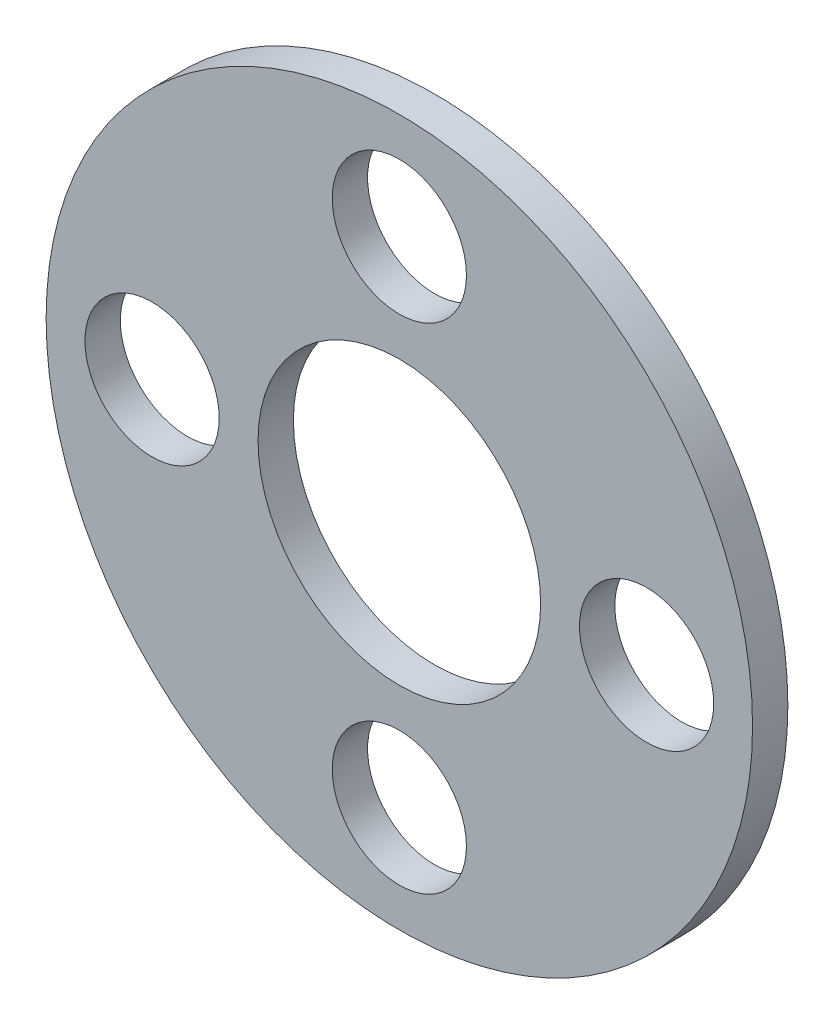
ISO-10303-21;
HEADER;
FILE_DESCRIPTION(('STEP AP214'),'2;1');
FILE_NAME('part.step','',(''),(''),'','','');
FILE_SCHEMA(('AUTOMOTIVE_DESIGN { 1 0 10303 214 1 1 1 1 }'));
ENDSEC;
DATA;
#1=APPLICATION_CONTEXT('core data for automotive mechanical design processes');
#2=APPLICATION_PROTOCOL_DEFINITION('international standard','automotive_design',2000,#1);
#3=PRODUCT_CONTEXT('',#1,'mechanical');
#4=PRODUCT('Part','Part','',(#3));
#5=PRODUCT_RELATED_PRODUCT_CATEGORY('part','',(#4));
#6=PRODUCT_DEFINITION_FORMATION('','',#4);
#7=PRODUCT_DEFINITION_CONTEXT('part definition',#1,'design');
#8=PRODUCT_DEFINITION('design','',#6,#7);
#9=PRODUCT_DEFINITION_SHAPE('','',#8);
#10=(LENGTH_UNIT() NAMED_UNIT(*) SI_UNIT(.MILLI.,.METRE.));
#11=(NAMED_UNIT(*) PLANE_ANGLE_UNIT() SI_UNIT($,.RADIAN.));
#12=(NAMED_UNIT(*) SI_UNIT($,.STERADIAN.) SOLID_ANGLE_UNIT());
#13=UNCERTAINTY_MEASURE_WITH_UNIT(LENGTH_MEASURE(1.E-05),#10,'distance_accuracy_value','');
#14=(GEOMETRIC_REPRESENTATION_CONTEXT(3) GLOBAL_UNCERTAINTY_ASSIGNED_CONTEXT((#13)) GLOBAL_UNIT_ASSIGNED_CONTEXT((#10,
#11,#12)) REPRESENTATION_CONTEXT('',''));
#15=CARTESIAN_POINT('',(0.,0.,0.));
#16=DIRECTION('',(0.,0.,1.));
#17=DIRECTION('',(1.,0.,0.));
#18=AXIS2_PLACEMENT_3D('',#15,#16,#17);
#19=CARTESIAN_POINT('',(0.,0.,1.));
#20=DIRECTION('',(0.,0.,1.));
#21=DIRECTION('',(1.,0.,0.));
#22=AXIS2_PLACEMENT_3D('',#19,#20,#21);
#23=PLANE('',#22);
#24=CARTESIAN_POINT('',(0.,-7.,1.));
#25=DIRECTION('',(0.,0.,1.));
#26=DIRECTION('',(1.,0.,0.));
#27=AXIS2_PLACEMENT_3D('',#24,#25,#26);
#28=CIRCLE('',#27,1.9);
#29=CARTESIAN_POINT('',(1.9,-7.,1.));
#30=VERTEX_POINT('',#29);
#31=EDGE_CURVE('E55',#30,#30,#28,.T.);
#32=ORIENTED_EDGE('',*,*,#31,.F.);
#33=EDGE_LOOP('',(#32));
#34=FACE_BOUND('',#33,.T.);
#35=CARTESIAN_POINT('',(-7.,0.,1.));
#36=DIRECTION('',(0.,0.,1.));
#37=DIRECTION('',(1.,0.,0.));
#38=AXIS2_PLACEMENT_3D('',#35,#36,#37);
#39=CIRCLE('',#38,1.9);
#40=CARTESIAN_POINT('',(-5.1,0.,1.));
#41=VERTEX_POINT('',#40);
#42=EDGE_CURVE('E58',#41,#41,#39,.T.);
#43=ORIENTED_EDGE('',*,*,#42,.F.);
#44=EDGE_LOOP('',(#43));
#45=FACE_BOUND('',#44,.T.);
#46=CARTESIAN_POINT('',(0.,7.,1.));
#47=DIRECTION('',(0.,0.,1.));
#48=DIRECTION('',(1.,0.,0.));
#49=AXIS2_PLACEMENT_3D('',#46,#47,#48);
#50=CIRCLE('',#49,1.9);
#51=CARTESIAN_POINT('',(1.9,7.,1.));
#52=VERTEX_POINT('',#51);
#53=EDGE_CURVE('E61',#52,#52,#50,.T.);
#54=ORIENTED_EDGE('',*,*,#53,.F.);
#55=EDGE_LOOP('',(#54));
#56=FACE_BOUND('',#55,.T.);
#57=CARTESIAN_POINT('',(7.,0.,1.));
#58=DIRECTION('',(0.,0.,1.));
#59=DIRECTION('',(1.,0.,0.));
#60=AXIS2_PLACEMENT_3D('',#57,#58,#59);
#61=CIRCLE('',#60,1.9);
#62=CARTESIAN_POINT('',(8.9,0.,1.));
#63=VERTEX_POINT('',#62);
#64=EDGE_CURVE('E47',#63,#63,#61,.T.);
#65=ORIENTED_EDGE('',*,*,#64,.F.);
#66=EDGE_LOOP('',(#65));
#67=FACE_BOUND('',#66,.T.);
#68=CARTESIAN_POINT('',(0.,0.,1.));
#69=DIRECTION('',(0.,0.,1.));
#70=DIRECTION('',(1.,0.,0.));
#71=AXIS2_PLACEMENT_3D('',#68,#69,#70);
#72=CIRCLE('',#71,10.);
#73=CARTESIAN_POINT('',(10.,0.,1.));
#74=VERTEX_POINT('',#73);
#75=EDGE_CURVE('E10',#74,#74,#72,.T.);
#76=ORIENTED_EDGE('',*,*,#75,.T.);
#77=EDGE_LOOP('',(#76));
#78=FACE_BOUND('',#77,.T.);
#79=CARTESIAN_POINT('',(0.,0.,1.));
#80=DIRECTION('',(0.,0.,1.));
#81=DIRECTION('',(1.,0.,0.));
#82=AXIS2_PLACEMENT_3D('',#79,#80,#81);
#83=CIRCLE('',#82,4.);
#84=CARTESIAN_POINT('',(4.,0.,1.));
#85=VERTEX_POINT('',#84);
#86=EDGE_CURVE('E42',#85,#85,#83,.T.);
#87=ORIENTED_EDGE('',*,*,#86,.F.);
#88=EDGE_LOOP('',(#87));
#89=FACE_BOUND('',#88,.T.);
#90=ADVANCED_FACE('F31',(#34,#45,#56,#67,#78,#89),#23,.T.);
#91=CARTESIAN_POINT('',(0.,0.,0.));
#92=DIRECTION('',(0.,0.,1.));
#93=DIRECTION('',(1.,0.,0.));
#94=AXIS2_PLACEMENT_3D('',#91,#92,#93);
#95=PLANE('',#94);
#96=CARTESIAN_POINT('',(0.,-7.,0.));
#97=DIRECTION('',(0.,0.,1.));
#98=DIRECTION('',(1.,0.,0.));
#99=AXIS2_PLACEMENT_3D('',#96,#97,#98);
#100=CIRCLE('',#99,1.9);
#101=CARTESIAN_POINT('',(1.9,-7.,0.));
#102=VERTEX_POINT('',#101);
#103=EDGE_CURVE('E64',#102,#102,#100,.T.);
#104=ORIENTED_EDGE('',*,*,#103,.T.);
#105=EDGE_LOOP('',(#104));
#106=FACE_BOUND('',#105,.T.);
#107=CARTESIAN_POINT('',(-7.,0.,0.));
#108=DIRECTION('',(0.,0.,1.));
#109=DIRECTION('',(1.,0.,0.));
#110=AXIS2_PLACEMENT_3D('',#107,#108,#109);
#111=CIRCLE('',#110,1.9);
#112=CARTESIAN_POINT('',(-5.1,0.,0.));
#113=VERTEX_POINT('',#112);
#114=EDGE_CURVE('E68',#113,#113,#111,.T.);
#115=ORIENTED_EDGE('',*,*,#114,.T.);
#116=EDGE_LOOP('',(#115));
#117=FACE_BOUND('',#116,.T.);
#118=CARTESIAN_POINT('',(0.,7.,0.));
#119=DIRECTION('',(0.,0.,1.));
#120=DIRECTION('',(1.,0.,0.));
#121=AXIS2_PLACEMENT_3D('',#118,#119,#120);
#122=CIRCLE('',#121,1.9);
#123=CARTESIAN_POINT('',(1.9,7.,0.));
#124=VERTEX_POINT('',#123);
#125=EDGE_CURVE('E65',#124,#124,#122,.T.);
#126=ORIENTED_EDGE('',*,*,#125,.T.);
#127=EDGE_LOOP('',(#126));
#128=FACE_BOUND('',#127,.T.);
#129=CARTESIAN_POINT('',(7.,0.,0.));
#130=DIRECTION('',(0.,0.,1.));
#131=DIRECTION('',(1.,0.,0.));
#132=AXIS2_PLACEMENT_3D('',#129,#130,#131);
#133=CIRCLE('',#132,1.9);
#134=CARTESIAN_POINT('',(8.9,0.,0.));
#135=VERTEX_POINT('',#134);
#136=EDGE_CURVE('E52',#135,#135,#133,.T.);
#137=ORIENTED_EDGE('',*,*,#136,.T.);
#138=EDGE_LOOP('',(#137));
#139=FACE_BOUND('',#138,.T.);
#140=CARTESIAN_POINT('',(0.,0.,0.));
#141=DIRECTION('',(0.,0.,1.));
#142=DIRECTION('',(1.,0.,0.));
#143=AXIS2_PLACEMENT_3D('',#140,#141,#142);
#144=CIRCLE('',#143,10.);
#145=CARTESIAN_POINT('',(10.,0.,0.));
#146=VERTEX_POINT('',#145);
#147=EDGE_CURVE('E35',#146,#146,#144,.T.);
#148=ORIENTED_EDGE('',*,*,#147,.F.);
#149=EDGE_LOOP('',(#148));
#150=FACE_BOUND('',#149,.T.);
#151=CARTESIAN_POINT('',(0.,0.,0.));
#152=DIRECTION('',(0.,0.,1.));
#153=DIRECTION('',(1.,0.,0.));
#154=AXIS2_PLACEMENT_3D('',#151,#152,#153);
#155=CIRCLE('',#154,4.);
#156=CARTESIAN_POINT('',(4.,0.,0.));
#157=VERTEX_POINT('',#156);
#158=EDGE_CURVE('E44',#157,#157,#155,.T.);
#159=ORIENTED_EDGE('',*,*,#158,.T.);
#160=EDGE_LOOP('',(#159));
#161=FACE_BOUND('',#160,.T.);
#162=ADVANCED_FACE('F74',(#106,#117,#128,#139,#150,#161),#95,.F.);
#163=CARTESIAN_POINT('',(0.,0.,1.));
#164=DIRECTION('',(0.,0.,-1.));
#165=DIRECTION('',(-1.,0.,0.));
#166=AXIS2_PLACEMENT_3D('',#163,#164,#165);
#167=CYLINDRICAL_SURFACE('',#166,10.);
#168=ORIENTED_EDGE('',*,*,#75,.F.);
#169=EDGE_LOOP('',(#168));
#170=FACE_BOUND('',#169,.T.);
#171=ORIENTED_EDGE('',*,*,#147,.T.);
#172=EDGE_LOOP('',(#171));
#173=FACE_BOUND('',#172,.T.);
#174=ADVANCED_FACE('F33',(#170,#173),#167,.T.);
#175=CARTESIAN_POINT('',(0.,0.,1.));
#176=DIRECTION('',(0.,0.,-1.));
#177=DIRECTION('',(-1.,0.,0.));
#178=AXIS2_PLACEMENT_3D('',#175,#176,#177);
#179=CYLINDRICAL_SURFACE('',#178,4.);
#180=ORIENTED_EDGE('',*,*,#86,.T.);
#181=EDGE_LOOP('',(#180));
#182=FACE_BOUND('',#181,.T.);
#183=ORIENTED_EDGE('',*,*,#158,.F.);
#184=EDGE_LOOP('',(#183));
#185=FACE_BOUND('',#184,.T.);
#186=ADVANCED_FACE('F97',(#182,#185),#179,.F.);
#187=CARTESIAN_POINT('',(7.,0.,0.));
#188=DIRECTION('',(0.,0.,1.));
#189=DIRECTION('',(1.,0.,0.));
#190=AXIS2_PLACEMENT_3D('',#187,#188,#189);
#191=CYLINDRICAL_SURFACE('',#190,1.9);
#192=ORIENTED_EDGE('',*,*,#64,.T.);
#193=EDGE_LOOP('',(#192));
#194=FACE_BOUND('',#193,.T.);
#195=ORIENTED_EDGE('',*,*,#136,.F.);
#196=EDGE_LOOP('',(#195));
#197=FACE_BOUND('',#196,.T.);
#198=ADVANCED_FACE('F100',(#194,#197),#191,.F.);
#199=CARTESIAN_POINT('',(0.,7.,0.));
#200=DIRECTION('',(0.,0.,1.));
#201=DIRECTION('',(1.,0.,0.));
#202=AXIS2_PLACEMENT_3D('',#199,#200,#201);
#203=CYLINDRICAL_SURFACE('',#202,1.9);
#204=ORIENTED_EDGE('',*,*,#53,.T.);
#205=EDGE_LOOP('',(#204));
#206=FACE_BOUND('',#205,.T.);
#207=ORIENTED_EDGE('',*,*,#125,.F.);
#208=EDGE_LOOP('',(#207));
#209=FACE_BOUND('',#208,.T.);
#210=ADVANCED_FACE('F85',(#206,#209),#203,.F.);
#211=CARTESIAN_POINT('',(-7.,0.,0.));
#212=DIRECTION('',(0.,0.,1.));
#213=DIRECTION('',(1.,0.,0.));
#214=AXIS2_PLACEMENT_3D('',#211,#212,#213);
#215=CYLINDRICAL_SURFACE('',#214,1.9);
#216=ORIENTED_EDGE('',*,*,#42,.T.);
#217=EDGE_LOOP('',(#216));
#218=FACE_BOUND('',#217,.T.);
#219=ORIENTED_EDGE('',*,*,#114,.F.);
#220=EDGE_LOOP('',(#219));
#221=FACE_BOUND('',#220,.T.);
#222=ADVANCED_FACE('F79',(#218,#221),#215,.F.);
#223=CARTESIAN_POINT('',(0.,-7.,0.));
#224=DIRECTION('',(0.,0.,1.));
#225=DIRECTION('',(1.,0.,0.));
#226=AXIS2_PLACEMENT_3D('',#223,#224,#225);
#227=CYLINDRICAL_SURFACE('',#226,1.9);
#228=ORIENTED_EDGE('',*,*,#31,.T.);
#229=EDGE_LOOP('',(#228));
#230=FACE_BOUND('',#229,.T.);
#231=ORIENTED_EDGE('',*,*,#103,.F.);
#232=EDGE_LOOP('',(#231));
#233=FACE_BOUND('',#232,.T.);
#234=ADVANCED_FACE('F77',(#230,#233),#227,.F.);
#235=CLOSED_SHELL('',(#90,#162,#174,#186,#198,#210,#222,#234));
#236=MANIFOLD_SOLID_BREP('B2',#235);
#237=ADVANCED_BREP_SHAPE_REPRESENTATION('',(#18,#236),#14);
#238=SHAPE_DEFINITION_REPRESENTATION(#9,#237);
ENDSEC;
END-ISO-10303-21;
